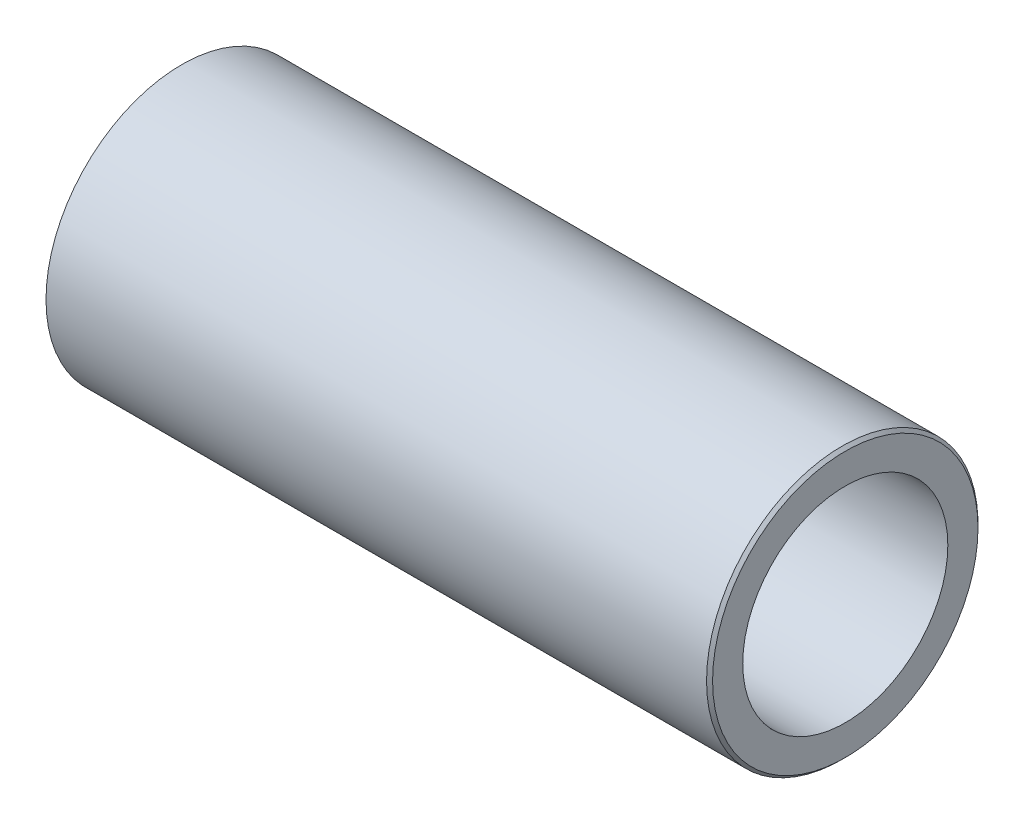
ISO-10303-21;
HEADER;
FILE_DESCRIPTION(('STEP AP214'),'2;1');
FILE_NAME('part.step','',(''),(''),'','','');
FILE_SCHEMA(('AUTOMOTIVE_DESIGN { 1 0 10303 214 1 1 1 1 }'));
ENDSEC;
DATA;
#1=APPLICATION_CONTEXT('core data for automotive mechanical design processes');
#2=APPLICATION_PROTOCOL_DEFINITION('international standard','automotive_design',2000,#1);
#3=PRODUCT_CONTEXT('',#1,'mechanical');
#4=PRODUCT('Part','Part','',(#3));
#5=PRODUCT_RELATED_PRODUCT_CATEGORY('part','',(#4));
#6=PRODUCT_DEFINITION_FORMATION('','',#4);
#7=PRODUCT_DEFINITION_CONTEXT('part definition',#1,'design');
#8=PRODUCT_DEFINITION('design','',#6,#7);
#9=PRODUCT_DEFINITION_SHAPE('','',#8);
#10=(LENGTH_UNIT() NAMED_UNIT(*) SI_UNIT(.MILLI.,.METRE.));
#11=(NAMED_UNIT(*) PLANE_ANGLE_UNIT() SI_UNIT($,.RADIAN.));
#12=(NAMED_UNIT(*) SI_UNIT($,.STERADIAN.) SOLID_ANGLE_UNIT());
#13=UNCERTAINTY_MEASURE_WITH_UNIT(LENGTH_MEASURE(1.E-05),#10,'distance_accuracy_value','');
#14=(GEOMETRIC_REPRESENTATION_CONTEXT(3) GLOBAL_UNCERTAINTY_ASSIGNED_CONTEXT((#13)) GLOBAL_UNIT_ASSIGNED_CONTEXT((#10,
#11,#12)) REPRESENTATION_CONTEXT('',''));
#15=CARTESIAN_POINT('',(0.,0.,0.));
#16=DIRECTION('',(0.,0.,1.));
#17=DIRECTION('',(1.,0.,0.));
#18=AXIS2_PLACEMENT_3D('',#15,#16,#17);
#19=CARTESIAN_POINT('',(-55.,22.5,0.));
#20=DIRECTION('',(1.,0.,0.));
#21=DIRECTION('',(0.,0.,-1.));
#22=AXIS2_PLACEMENT_3D('',#19,#20,#21);
#23=PLANE('',#22);
#24=CARTESIAN_POINT('',(-55.,0.,0.));
#25=DIRECTION('',(-1.,0.,0.));
#26=DIRECTION('',(0.,0.,1.));
#27=AXIS2_PLACEMENT_3D('',#24,#25,#26);
#28=CIRCLE('',#27,9.);
#29=CARTESIAN_POINT('',(-55.,0.,9.));
#30=VERTEX_POINT('',#29);
#31=EDGE_CURVE('E10',#30,#30,#28,.T.);
#32=ORIENTED_EDGE('',*,*,#31,.F.);
#33=EDGE_LOOP('',(#32));
#34=FACE_BOUND('',#33,.T.);
#35=CARTESIAN_POINT('',(-55.,0.,0.));
#36=DIRECTION('',(-1.,0.,0.));
#37=DIRECTION('',(0.,0.,1.));
#38=AXIS2_PLACEMENT_3D('',#35,#36,#37);
#39=CIRCLE('',#38,22.5);
#40=CARTESIAN_POINT('',(-55.,0.,22.5));
#41=VERTEX_POINT('',#40);
#42=EDGE_CURVE('E66',#41,#41,#39,.T.);
#43=ORIENTED_EDGE('',*,*,#42,.T.);
#44=EDGE_LOOP('',(#43));
#45=FACE_BOUND('',#44,.T.);
#46=ADVANCED_FACE('F35',(#34,#45),#23,.F.);
#47=CARTESIAN_POINT('',(-55.,0.,0.));
#48=DIRECTION('',(-1.,0.,0.));
#49=DIRECTION('',(0.,0.,1.));
#50=AXIS2_PLACEMENT_3D('',#47,#48,#49);
#51=CYLINDRICAL_SURFACE('',#50,9.);
#52=CARTESIAN_POINT('',(-51.,0.,0.));
#53=DIRECTION('',(-1.,0.,0.));
#54=DIRECTION('',(0.,0.,1.));
#55=AXIS2_PLACEMENT_3D('',#52,#53,#54);
#56=CIRCLE('',#55,9.);
#57=CARTESIAN_POINT('',(-51.,0.,9.));
#58=VERTEX_POINT('',#57);
#59=EDGE_CURVE('E41',#58,#58,#56,.T.);
#60=ORIENTED_EDGE('',*,*,#59,.F.);
#61=EDGE_LOOP('',(#60));
#62=FACE_BOUND('',#61,.T.);
#63=ORIENTED_EDGE('',*,*,#31,.T.);
#64=EDGE_LOOP('',(#63));
#65=FACE_BOUND('',#64,.T.);
#66=ADVANCED_FACE('F109',(#62,#65),#51,.F.);
#67=CARTESIAN_POINT('',(-51.,9.,0.));
#68=DIRECTION('',(-1.,0.,0.));
#69=DIRECTION('',(0.,0.,1.));
#70=AXIS2_PLACEMENT_3D('',#67,#68,#69);
#71=PLANE('',#70);
#72=CARTESIAN_POINT('',(-51.,0.,0.));
#73=DIRECTION('',(-1.,0.,0.));
#74=DIRECTION('',(0.,0.,1.));
#75=AXIS2_PLACEMENT_3D('',#72,#73,#74);
#76=CIRCLE('',#75,12.);
#77=CARTESIAN_POINT('',(-51.,0.,12.));
#78=VERTEX_POINT('',#77);
#79=EDGE_CURVE('E45',#78,#78,#76,.T.);
#80=ORIENTED_EDGE('',*,*,#79,.F.);
#81=EDGE_LOOP('',(#80));
#82=FACE_BOUND('',#81,.T.);
#83=ORIENTED_EDGE('',*,*,#59,.T.);
#84=EDGE_LOOP('',(#83));
#85=FACE_BOUND('',#84,.T.);
#86=ADVANCED_FACE('F104',(#82,#85),#71,.F.);
#87=CARTESIAN_POINT('',(-55.,0.,0.));
#88=DIRECTION('',(-1.,0.,0.));
#89=DIRECTION('',(0.,0.,1.));
#90=AXIS2_PLACEMENT_3D('',#87,#88,#89);
#91=CYLINDRICAL_SURFACE('',#90,12.);
#92=CARTESIAN_POINT('',(9.,0.,0.));
#93=DIRECTION('',(-1.,0.,0.));
#94=DIRECTION('',(0.,0.,1.));
#95=AXIS2_PLACEMENT_3D('',#92,#93,#94);
#96=CIRCLE('',#95,12.);
#97=CARTESIAN_POINT('',(9.,0.,12.));
#98=VERTEX_POINT('',#97);
#99=EDGE_CURVE('E49',#98,#98,#96,.T.);
#100=ORIENTED_EDGE('',*,*,#99,.F.);
#101=EDGE_LOOP('',(#100));
#102=FACE_BOUND('',#101,.T.);
#103=ORIENTED_EDGE('',*,*,#79,.T.);
#104=EDGE_LOOP('',(#103));
#105=FACE_BOUND('',#104,.T.);
#106=ADVANCED_FACE('F98',(#102,#105),#91,.F.);
#107=CARTESIAN_POINT('',(8.99999999999999,12.,0.));
#108=DIRECTION('',(-1.,0.,0.));
#109=DIRECTION('',(0.,0.,1.));
#110=AXIS2_PLACEMENT_3D('',#107,#108,#109);
#111=PLANE('',#110);
#112=CARTESIAN_POINT('',(9.,0.,0.));
#113=DIRECTION('',(-1.,0.,0.));
#114=DIRECTION('',(0.,0.,1.));
#115=AXIS2_PLACEMENT_3D('',#112,#113,#114);
#116=CIRCLE('',#115,17.);
#117=CARTESIAN_POINT('',(9.,0.,17.));
#118=VERTEX_POINT('',#117);
#119=EDGE_CURVE('E54',#118,#118,#116,.T.);
#120=ORIENTED_EDGE('',*,*,#119,.F.);
#121=EDGE_LOOP('',(#120));
#122=FACE_BOUND('',#121,.T.);
#123=ORIENTED_EDGE('',*,*,#99,.T.);
#124=EDGE_LOOP('',(#123));
#125=FACE_BOUND('',#124,.T.);
#126=ADVANCED_FACE('F92',(#122,#125),#111,.F.);
#127=CARTESIAN_POINT('',(-55.,0.,0.));
#128=DIRECTION('',(-1.,0.,0.));
#129=DIRECTION('',(0.,0.,1.));
#130=AXIS2_PLACEMENT_3D('',#127,#128,#129);
#131=CYLINDRICAL_SURFACE('',#130,17.);
#132=CARTESIAN_POINT('',(55.,0.,0.));
#133=DIRECTION('',(-1.,0.,0.));
#134=DIRECTION('',(0.,0.,1.));
#135=AXIS2_PLACEMENT_3D('',#132,#133,#134);
#136=CIRCLE('',#135,17.);
#137=CARTESIAN_POINT('',(55.,0.,17.));
#138=VERTEX_POINT('',#137);
#139=EDGE_CURVE('E57',#138,#138,#136,.T.);
#140=ORIENTED_EDGE('',*,*,#139,.F.);
#141=EDGE_LOOP('',(#140));
#142=FACE_BOUND('',#141,.T.);
#143=ORIENTED_EDGE('',*,*,#119,.T.);
#144=EDGE_LOOP('',(#143));
#145=FACE_BOUND('',#144,.T.);
#146=ADVANCED_FACE('F86',(#142,#145),#131,.F.);
#147=CARTESIAN_POINT('',(55.,17.,0.));
#148=DIRECTION('',(-1.,0.,0.));
#149=DIRECTION('',(0.,0.,1.));
#150=AXIS2_PLACEMENT_3D('',#147,#148,#149);
#151=PLANE('',#150);
#152=CARTESIAN_POINT('',(55.,0.,0.));
#153=DIRECTION('',(-1.,0.,0.));
#154=DIRECTION('',(0.,0.,1.));
#155=AXIS2_PLACEMENT_3D('',#152,#153,#154);
#156=CIRCLE('',#155,22.);
#157=CARTESIAN_POINT('',(55.,0.,22.));
#158=VERTEX_POINT('',#157);
#159=EDGE_CURVE('E60',#158,#158,#156,.T.);
#160=ORIENTED_EDGE('',*,*,#159,.F.);
#161=EDGE_LOOP('',(#160));
#162=FACE_BOUND('',#161,.T.);
#163=ORIENTED_EDGE('',*,*,#139,.T.);
#164=EDGE_LOOP('',(#163));
#165=FACE_BOUND('',#164,.T.);
#166=ADVANCED_FACE('F80',(#162,#165),#151,.F.);
#167=CARTESIAN_POINT('',(55.,0.,0.));
#168=DIRECTION('',(-1.,0.,0.));
#169=DIRECTION('',(0.,0.,1.));
#170=AXIS2_PLACEMENT_3D('',#167,#168,#169);
#171=CONICAL_SURFACE('',#170,22.,0.785398163397445);
#172=CARTESIAN_POINT('',(54.5,0.,0.));
#173=DIRECTION('',(-1.,0.,0.));
#174=DIRECTION('',(0.,0.,1.));
#175=AXIS2_PLACEMENT_3D('',#172,#173,#174);
#176=CIRCLE('',#175,22.5);
#177=CARTESIAN_POINT('',(54.5,0.,22.5));
#178=VERTEX_POINT('',#177);
#179=EDGE_CURVE('E63',#178,#178,#176,.T.);
#180=ORIENTED_EDGE('',*,*,#179,.F.);
#181=EDGE_LOOP('',(#180));
#182=FACE_BOUND('',#181,.T.);
#183=ORIENTED_EDGE('',*,*,#159,.T.);
#184=EDGE_LOOP('',(#183));
#185=FACE_BOUND('',#184,.T.);
#186=ADVANCED_FACE('F74',(#182,#185),#171,.T.);
#187=CARTESIAN_POINT('',(-55.,0.,0.));
#188=DIRECTION('',(-1.,0.,0.));
#189=DIRECTION('',(0.,0.,1.));
#190=AXIS2_PLACEMENT_3D('',#187,#188,#189);
#191=CYLINDRICAL_SURFACE('',#190,22.5);
#192=ORIENTED_EDGE('',*,*,#42,.F.);
#193=EDGE_LOOP('',(#192));
#194=FACE_BOUND('',#193,.T.);
#195=ORIENTED_EDGE('',*,*,#179,.T.);
#196=EDGE_LOOP('',(#195));
#197=FACE_BOUND('',#196,.T.);
#198=ADVANCED_FACE('F71',(#194,#197),#191,.T.);
#199=CLOSED_SHELL('',(#46,#66,#86,#106,#126,#146,#166,#186,#198));
#200=MANIFOLD_SOLID_BREP('B2',#199);
#201=ADVANCED_BREP_SHAPE_REPRESENTATION('',(#18,#200),#14);
#202=SHAPE_DEFINITION_REPRESENTATION(#9,#201);
ENDSEC;
END-ISO-10303-21;
